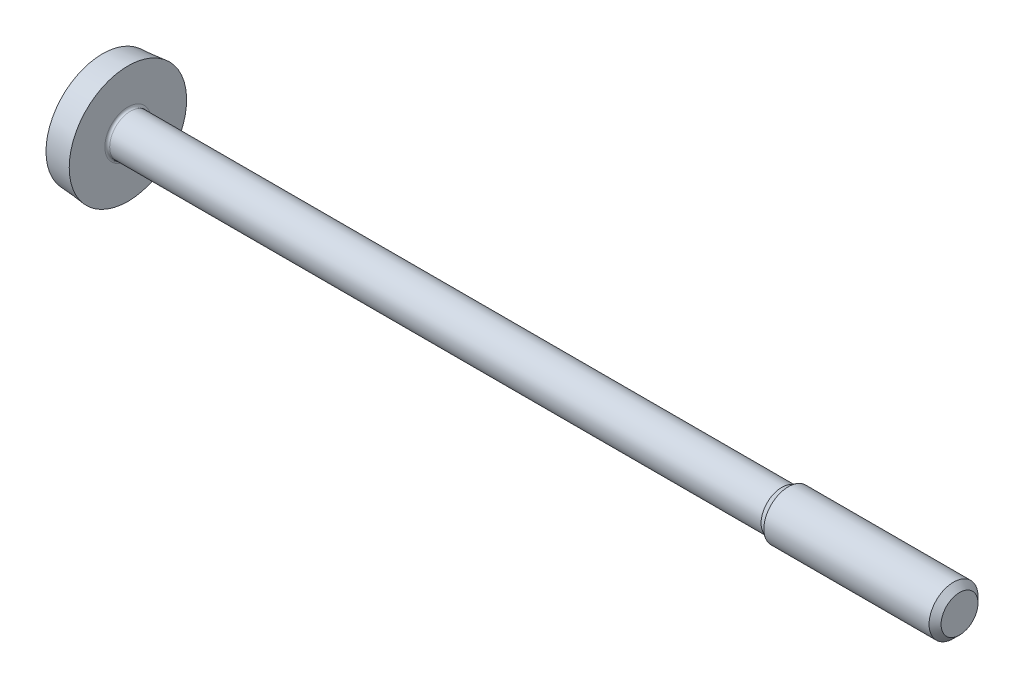
ISO-10303-21;
HEADER;
FILE_DESCRIPTION(('STEP AP214'),'2;1');
FILE_NAME('part.step','',(''),(''),'','','');
FILE_SCHEMA(('AUTOMOTIVE_DESIGN { 1 0 10303 214 1 1 1 1 }'));
ENDSEC;
DATA;
#1=APPLICATION_CONTEXT('core data for automotive mechanical design processes');
#2=APPLICATION_PROTOCOL_DEFINITION('international standard','automotive_design',2000,#1);
#3=PRODUCT_CONTEXT('',#1,'mechanical');
#4=PRODUCT('Part','Part','',(#3));
#5=PRODUCT_RELATED_PRODUCT_CATEGORY('part','',(#4));
#6=PRODUCT_DEFINITION_FORMATION('','',#4);
#7=PRODUCT_DEFINITION_CONTEXT('part definition',#1,'design');
#8=PRODUCT_DEFINITION('design','',#6,#7);
#9=PRODUCT_DEFINITION_SHAPE('','',#8);
#10=(LENGTH_UNIT() NAMED_UNIT(*) SI_UNIT(.MILLI.,.METRE.));
#11=(NAMED_UNIT(*) PLANE_ANGLE_UNIT() SI_UNIT($,.RADIAN.));
#12=(NAMED_UNIT(*) SI_UNIT($,.STERADIAN.) SOLID_ANGLE_UNIT());
#13=UNCERTAINTY_MEASURE_WITH_UNIT(LENGTH_MEASURE(1.E-05),#10,'distance_accuracy_value','');
#14=(GEOMETRIC_REPRESENTATION_CONTEXT(3) GLOBAL_UNCERTAINTY_ASSIGNED_CONTEXT((#13)) GLOBAL_UNIT_ASSIGNED_CONTEXT((#10,
#11,#12)) REPRESENTATION_CONTEXT('',''));
#15=CARTESIAN_POINT('',(0.,0.,0.));
#16=DIRECTION('',(0.,0.,1.));
#17=DIRECTION('',(1.,0.,0.));
#18=AXIS2_PLACEMENT_3D('',#15,#16,#17);
#19=CARTESIAN_POINT('',(3.44029950540034,2.65954792910694E-13,0.));
#20=DIRECTION('',(-1.,0.,0.));
#21=DIRECTION('',(0.,1.,0.));
#22=AXIS2_PLACEMENT_3D('',#19,#20,#21);
#23=SPHERICAL_SURFACE('',#22,5.04029950540034);
#24=CARTESIAN_POINT('',(3.44029950540034,0.29,0.));
#25=DIRECTION('',(0.,1.,0.));
#26=DIRECTION('',(0.,0.,1.));
#27=AXIS2_PLACEMENT_3D('',#24,#25,#26);
#28=CIRCLE('',#27,5.03194983124226);
#29=CARTESIAN_POINT('',(-1.49128432782597,0.29,-1.));
#30=VERTEX_POINT('',#29);
#31=CARTESIAN_POINT('',(-1.58328677375712,0.29,-0.29));
#32=VERTEX_POINT('',#31);
#33=EDGE_CURVE('E11',#30,#32,#28,.T.);
#34=ORIENTED_EDGE('',*,*,#33,.T.);
#35=CARTESIAN_POINT('',(3.44029950540034,2.65954792910694E-13,-0.29));
#36=DIRECTION('',(0.,0.,-1.));
#37=DIRECTION('',(-1.,0.,0.));
#38=AXIS2_PLACEMENT_3D('',#35,#36,#37);
#39=CIRCLE('',#38,5.03194983124225);
#40=CARTESIAN_POINT('',(-1.04,2.29072814756566,-0.29));
#41=VERTEX_POINT('',#40);
#42=EDGE_CURVE('E178',#32,#41,#39,.T.);
#43=ORIENTED_EDGE('',*,*,#42,.T.);
#44=CARTESIAN_POINT('',(-1.04,0.,0.));
#45=DIRECTION('',(-1.,0.,0.));
#46=DIRECTION('',(0.,0.,1.));
#47=AXIS2_PLACEMENT_3D('',#44,#45,#46);
#48=CIRCLE('',#47,2.309011789933);
#49=CARTESIAN_POINT('',(-1.04,-2.29072814756566,-0.29));
#50=VERTEX_POINT('',#49);
#51=EDGE_CURVE('E208',#41,#50,#48,.T.);
#52=ORIENTED_EDGE('',*,*,#51,.T.);
#53=CARTESIAN_POINT('',(3.44029950540034,2.65954792910694E-13,-0.29));
#54=DIRECTION('',(0.,0.,-1.));
#55=DIRECTION('',(-1.,0.,0.));
#56=AXIS2_PLACEMENT_3D('',#53,#54,#55);
#57=CIRCLE('',#56,5.03194983124225);
#58=CARTESIAN_POINT('',(-1.58328677375709,-0.29,-0.29));
#59=VERTEX_POINT('',#58);
#60=EDGE_CURVE('E175',#50,#59,#57,.T.);
#61=ORIENTED_EDGE('',*,*,#60,.T.);
#62=CARTESIAN_POINT('',(3.44029950540034,-0.29,0.));
#63=DIRECTION('',(0.,-1.,0.));
#64=DIRECTION('',(0.,0.,-1.));
#65=AXIS2_PLACEMENT_3D('',#62,#63,#64);
#66=CIRCLE('',#65,5.03194983124223);
#67=CARTESIAN_POINT('',(-1.49128432782593,-0.29,-1.));
#68=VERTEX_POINT('',#67);
#69=EDGE_CURVE('E215',#59,#68,#66,.T.);
#70=ORIENTED_EDGE('',*,*,#69,.T.);
#71=CARTESIAN_POINT('',(3.44029950540034,2.65954792910694E-13,-1.));
#72=DIRECTION('',(0.,0.,-1.));
#73=DIRECTION('',(-1.,0.,0.));
#74=AXIS2_PLACEMENT_3D('',#71,#72,#73);
#75=CIRCLE('',#74,4.94010314711534);
#76=EDGE_CURVE('E44',#68,#30,#75,.T.);
#77=ORIENTED_EDGE('',*,*,#76,.T.);
#78=EDGE_LOOP('',(#34,#43,#52,#61,#70,#77));
#79=FACE_BOUND('',#78,.T.);
#80=ADVANCED_FACE('F36',(#79),#23,.T.);
#81=CARTESIAN_POINT('',(-1.04,-2.29072814756566,0.29));
#82=VERTEX_POINT('',#81);
#83=CARTESIAN_POINT('',(-1.04,2.29072814756566,0.29));
#84=VERTEX_POINT('',#83);
#85=EDGE_CURVE('E205',#82,#84,#48,.T.);
#86=ORIENTED_EDGE('',*,*,#85,.T.);
#87=CARTESIAN_POINT('',(3.44029950540034,2.65954792910694E-13,0.29));
#88=DIRECTION('',(0.,0.,1.));
#89=DIRECTION('',(1.,0.,0.));
#90=AXIS2_PLACEMENT_3D('',#87,#88,#89);
#91=CIRCLE('',#90,5.03194983124225);
#92=CARTESIAN_POINT('',(-1.58328677375712,0.29,0.29));
#93=VERTEX_POINT('',#92);
#94=EDGE_CURVE('E181',#84,#93,#91,.T.);
#95=ORIENTED_EDGE('',*,*,#94,.T.);
#96=CARTESIAN_POINT('',(3.44029950540034,0.29,0.));
#97=DIRECTION('',(0.,1.,0.));
#98=DIRECTION('',(0.,0.,1.));
#99=AXIS2_PLACEMENT_3D('',#96,#97,#98);
#100=CIRCLE('',#99,5.03194983124226);
#101=CARTESIAN_POINT('',(-1.49128432782597,0.29,1.));
#102=VERTEX_POINT('',#101);
#103=EDGE_CURVE('E213',#93,#102,#100,.T.);
#104=ORIENTED_EDGE('',*,*,#103,.T.);
#105=CARTESIAN_POINT('',(3.44029950540034,2.65954792910694E-13,1.));
#106=DIRECTION('',(0.,0.,1.));
#107=DIRECTION('',(1.,0.,0.));
#108=AXIS2_PLACEMENT_3D('',#105,#106,#107);
#109=CIRCLE('',#108,4.94010314711534);
#110=CARTESIAN_POINT('',(-1.49128432782593,-0.29,1.));
#111=VERTEX_POINT('',#110);
#112=EDGE_CURVE('E119',#102,#111,#109,.T.);
#113=ORIENTED_EDGE('',*,*,#112,.T.);
#114=CARTESIAN_POINT('',(3.44029950540034,-0.29,0.));
#115=DIRECTION('',(0.,-1.,0.));
#116=DIRECTION('',(0.,0.,-1.));
#117=AXIS2_PLACEMENT_3D('',#114,#115,#116);
#118=CIRCLE('',#117,5.03194983124223);
#119=CARTESIAN_POINT('',(-1.58328677375709,-0.29,0.29));
#120=VERTEX_POINT('',#119);
#121=EDGE_CURVE('E210',#111,#120,#118,.T.);
#122=ORIENTED_EDGE('',*,*,#121,.T.);
#123=CARTESIAN_POINT('',(3.44029950540034,2.65954792910694E-13,0.29));
#124=DIRECTION('',(0.,0.,1.));
#125=DIRECTION('',(1.,0.,0.));
#126=AXIS2_PLACEMENT_3D('',#123,#124,#125);
#127=CIRCLE('',#126,5.03194983124225);
#128=EDGE_CURVE('E161',#120,#82,#127,.T.);
#129=ORIENTED_EDGE('',*,*,#128,.T.);
#130=EDGE_LOOP('',(#86,#95,#104,#113,#122,#129));
#131=FACE_BOUND('',#130,.T.);
#132=ADVANCED_FACE('F38',(#131),#23,.T.);
#133=CARTESIAN_POINT('',(0.,0.,0.));
#134=DIRECTION('',(1.,0.,0.));
#135=DIRECTION('',(0.,0.,-1.));
#136=AXIS2_PLACEMENT_3D('',#133,#134,#135);
#137=CONICAL_SURFACE('',#136,2.4,0.0872664625997538);
#138=EDGE_CURVE('E206',#84,#41,#48,.T.);
#139=ORIENTED_EDGE('',*,*,#138,.F.);
#140=ORIENTED_EDGE('',*,*,#85,.F.);
#141=EDGE_CURVE('E238',#50,#82,#48,.T.);
#142=ORIENTED_EDGE('',*,*,#141,.F.);
#143=ORIENTED_EDGE('',*,*,#51,.F.);
#144=EDGE_LOOP('',(#139,#140,#142,#143));
#145=FACE_BOUND('',#144,.T.);
#146=CARTESIAN_POINT('',(0.,0.,0.));
#147=DIRECTION('',(-1.,0.,0.));
#148=DIRECTION('',(0.,0.,1.));
#149=AXIS2_PLACEMENT_3D('',#146,#147,#148);
#150=CIRCLE('',#149,2.4);
#151=CARTESIAN_POINT('',(0.,0.,2.4));
#152=VERTEX_POINT('',#151);
#153=EDGE_CURVE('E202',#152,#152,#150,.T.);
#154=ORIENTED_EDGE('',*,*,#153,.T.);
#155=EDGE_LOOP('',(#154));
#156=FACE_BOUND('',#155,.T.);
#157=ADVANCED_FACE('F235',(#145,#156),#137,.T.);
#158=CARTESIAN_POINT('',(0.,2.4,0.));
#159=DIRECTION('',(-1.,0.,0.));
#160=DIRECTION('',(0.,0.,1.));
#161=AXIS2_PLACEMENT_3D('',#158,#159,#160);
#162=PLANE('',#161);
#163=ORIENTED_EDGE('',*,*,#153,.F.);
#164=EDGE_LOOP('',(#163));
#165=FACE_BOUND('',#164,.T.);
#166=CARTESIAN_POINT('',(0.,0.,0.));
#167=DIRECTION('',(-1.,0.,0.));
#168=DIRECTION('',(0.,0.,1.));
#169=AXIS2_PLACEMENT_3D('',#166,#167,#168);
#170=CIRCLE('',#169,0.945);
#171=CARTESIAN_POINT('',(0.,0.,0.945));
#172=VERTEX_POINT('',#171);
#173=EDGE_CURVE('E199',#172,#172,#170,.T.);
#174=ORIENTED_EDGE('',*,*,#173,.T.);
#175=EDGE_LOOP('',(#174));
#176=FACE_BOUND('',#175,.T.);
#177=ADVANCED_FACE('F265',(#165,#176),#162,.F.);
#178=CARTESIAN_POINT('',(0.100000000000008,0.,0.));
#179=DIRECTION('',(-1.,0.,0.));
#180=DIRECTION('',(0.,0.,1.));
#181=AXIS2_PLACEMENT_3D('',#178,#179,#180);
#182=TOROIDAL_SURFACE('',#181,0.945000000000008,0.100000000000008);
#183=ORIENTED_EDGE('',*,*,#173,.F.);
#184=EDGE_LOOP('',(#183));
#185=FACE_BOUND('',#184,.T.);
#186=CARTESIAN_POINT('',(0.100000000000003,0.,0.));
#187=DIRECTION('',(-1.,0.,0.));
#188=DIRECTION('',(0.,0.,1.));
#189=AXIS2_PLACEMENT_3D('',#186,#187,#188);
#190=CIRCLE('',#189,0.845);
#191=CARTESIAN_POINT('',(0.100000000000003,0.,0.845));
#192=VERTEX_POINT('',#191);
#193=EDGE_CURVE('E196',#192,#192,#190,.T.);
#194=ORIENTED_EDGE('',*,*,#193,.T.);
#195=EDGE_LOOP('',(#194));
#196=FACE_BOUND('',#195,.T.);
#197=ADVANCED_FACE('F269',(#185,#196),#182,.F.);
#198=CARTESIAN_POINT('',(34.,0.,0.));
#199=DIRECTION('',(-1.,0.,0.));
#200=DIRECTION('',(0.,0.,1.));
#201=AXIS2_PLACEMENT_3D('',#198,#199,#200);
#202=CYLINDRICAL_SURFACE('',#201,0.845);
#203=ORIENTED_EDGE('',*,*,#193,.F.);
#204=EDGE_LOOP('',(#203));
#205=FACE_BOUND('',#204,.T.);
#206=CARTESIAN_POINT('',(26.731532124827,0.,0.));
#207=DIRECTION('',(-1.,0.,0.));
#208=DIRECTION('',(0.,0.,1.));
#209=AXIS2_PLACEMENT_3D('',#206,#207,#208);
#210=CIRCLE('',#209,0.845);
#211=CARTESIAN_POINT('',(26.731532124827,0.,0.845));
#212=VERTEX_POINT('',#211);
#213=EDGE_CURVE('E193',#212,#212,#210,.T.);
#214=ORIENTED_EDGE('',*,*,#213,.T.);
#215=EDGE_LOOP('',(#214));
#216=FACE_BOUND('',#215,.T.);
#217=ADVANCED_FACE('F275',(#205,#216),#202,.T.);
#218=CARTESIAN_POINT('',(27.,0.,0.));
#219=DIRECTION('',(1.,0.,0.));
#220=DIRECTION('',(0.,0.,-1.));
#221=AXIS2_PLACEMENT_3D('',#218,#219,#220);
#222=CONICAL_SURFACE('',#221,1.,0.523598775598586);
#223=ORIENTED_EDGE('',*,*,#213,.F.);
#224=EDGE_LOOP('',(#223));
#225=FACE_BOUND('',#224,.T.);
#226=CARTESIAN_POINT('',(27.,0.,0.));
#227=DIRECTION('',(-1.,0.,0.));
#228=DIRECTION('',(0.,0.,1.));
#229=AXIS2_PLACEMENT_3D('',#226,#227,#228);
#230=CIRCLE('',#229,1.);
#231=CARTESIAN_POINT('',(27.,0.,1.));
#232=VERTEX_POINT('',#231);
#233=EDGE_CURVE('E190',#232,#232,#230,.T.);
#234=ORIENTED_EDGE('',*,*,#233,.T.);
#235=EDGE_LOOP('',(#234));
#236=FACE_BOUND('',#235,.T.);
#237=ADVANCED_FACE('F279',(#225,#236),#222,.T.);
#238=CARTESIAN_POINT('',(34.,0.,0.));
#239=DIRECTION('',(-1.,0.,0.));
#240=DIRECTION('',(0.,0.,1.));
#241=AXIS2_PLACEMENT_3D('',#238,#239,#240);
#242=CYLINDRICAL_SURFACE('',#241,1.);
#243=ORIENTED_EDGE('',*,*,#233,.F.);
#244=EDGE_LOOP('',(#243));
#245=FACE_BOUND('',#244,.T.);
#246=CARTESIAN_POINT('',(33.7545,0.,0.));
#247=DIRECTION('',(-1.,0.,0.));
#248=DIRECTION('',(0.,0.,1.));
#249=AXIS2_PLACEMENT_3D('',#246,#247,#248);
#250=CIRCLE('',#249,1.);
#251=CARTESIAN_POINT('',(33.7545,0.,1.));
#252=VERTEX_POINT('',#251);
#253=EDGE_CURVE('E187',#252,#252,#250,.T.);
#254=ORIENTED_EDGE('',*,*,#253,.T.);
#255=EDGE_LOOP('',(#254));
#256=FACE_BOUND('',#255,.T.);
#257=ADVANCED_FACE('F283',(#245,#256),#242,.T.);
#258=CARTESIAN_POINT('',(34.,0.,0.));
#259=DIRECTION('',(-1.,0.,0.));
#260=DIRECTION('',(0.,0.,1.));
#261=AXIS2_PLACEMENT_3D('',#258,#259,#260);
#262=CONICAL_SURFACE('',#261,0.7545,0.785398163397443);
#263=ORIENTED_EDGE('',*,*,#253,.F.);
#264=EDGE_LOOP('',(#263));
#265=FACE_BOUND('',#264,.T.);
#266=CARTESIAN_POINT('',(34.,0.,0.));
#267=DIRECTION('',(-1.,0.,0.));
#268=DIRECTION('',(0.,0.,1.));
#269=AXIS2_PLACEMENT_3D('',#266,#267,#268);
#270=CIRCLE('',#269,0.7545);
#271=CARTESIAN_POINT('',(34.,0.,0.7545));
#272=VERTEX_POINT('',#271);
#273=EDGE_CURVE('E184',#272,#272,#270,.T.);
#274=ORIENTED_EDGE('',*,*,#273,.T.);
#275=EDGE_LOOP('',(#274));
#276=FACE_BOUND('',#275,.T.);
#277=ADVANCED_FACE('F287',(#265,#276),#262,.T.);
#278=CARTESIAN_POINT('',(34.,0.7545,0.));
#279=DIRECTION('',(-1.,0.,0.));
#280=DIRECTION('',(0.,0.,1.));
#281=AXIS2_PLACEMENT_3D('',#278,#279,#280);
#282=PLANE('',#281);
#283=ORIENTED_EDGE('',*,*,#273,.F.);
#284=EDGE_LOOP('',(#283));
#285=FACE_BOUND('',#284,.T.);
#286=ADVANCED_FACE('F291',(#285),#282,.F.);
#287=CARTESIAN_POINT('',(-1.64,0.29,0.29));
#288=DIRECTION('',(0.,1.,0.));
#289=DIRECTION('',(0.,0.,1.));
#290=AXIS2_PLACEMENT_3D('',#287,#288,#289);
#291=PLANE('',#290);
#292=DIRECTION('',(1.,0.,0.));
#293=VECTOR('',#292,1.);
#294=CARTESIAN_POINT('',(-1.64,0.29,0.29));
#295=LINE('',#294,#293);
#296=CARTESIAN_POINT('',(-1.04,0.29,0.29));
#297=VERTEX_POINT('',#296);
#298=EDGE_CURVE('E138',#93,#297,#295,.T.);
#299=ORIENTED_EDGE('',*,*,#298,.T.);
#300=DIRECTION('',(0.,0.,1.));
#301=VECTOR('',#300,1.);
#302=CARTESIAN_POINT('',(-1.04,0.29,0.29));
#303=LINE('',#302,#301);
#304=CARTESIAN_POINT('',(-1.04,0.29,1.));
#305=VERTEX_POINT('',#304);
#306=EDGE_CURVE('E131',#297,#305,#303,.T.);
#307=ORIENTED_EDGE('',*,*,#306,.T.);
#308=DIRECTION('',(1.,0.,0.));
#309=VECTOR('',#308,1.);
#310=CARTESIAN_POINT('',(-1.64,0.29,1.));
#311=LINE('',#310,#309);
#312=EDGE_CURVE('E113',#102,#305,#311,.T.);
#313=ORIENTED_EDGE('',*,*,#312,.F.);
#314=ORIENTED_EDGE('',*,*,#103,.F.);
#315=EDGE_LOOP('',(#299,#307,#313,#314));
#316=FACE_BOUND('',#315,.T.);
#317=ADVANCED_FACE('F136',(#316),#291,.F.);
#318=CARTESIAN_POINT('',(-1.64,0.29,-1.));
#319=DIRECTION('',(0.,1.,0.));
#320=DIRECTION('',(0.,0.,1.));
#321=AXIS2_PLACEMENT_3D('',#318,#319,#320);
#322=PLANE('',#321);
#323=DIRECTION('',(1.,0.,0.));
#324=VECTOR('',#323,1.);
#325=CARTESIAN_POINT('',(-1.64,0.29,-1.));
#326=LINE('',#325,#324);
#327=CARTESIAN_POINT('',(-1.04,0.29,-1.));
#328=VERTEX_POINT('',#327);
#329=EDGE_CURVE('E164',#30,#328,#326,.T.);
#330=ORIENTED_EDGE('',*,*,#329,.T.);
#331=DIRECTION('',(0.,0.,1.));
#332=VECTOR('',#331,1.);
#333=CARTESIAN_POINT('',(-1.04,0.29,-1.));
#334=LINE('',#333,#332);
#335=CARTESIAN_POINT('',(-1.04,0.29,-0.29));
#336=VERTEX_POINT('',#335);
#337=EDGE_CURVE('E153',#328,#336,#334,.T.);
#338=ORIENTED_EDGE('',*,*,#337,.T.);
#339=DIRECTION('',(1.,0.,0.));
#340=VECTOR('',#339,1.);
#341=CARTESIAN_POINT('',(-1.64,0.29,-0.29));
#342=LINE('',#341,#340);
#343=EDGE_CURVE('E162',#32,#336,#342,.T.);
#344=ORIENTED_EDGE('',*,*,#343,.F.);
#345=ORIENTED_EDGE('',*,*,#33,.F.);
#346=EDGE_LOOP('',(#330,#338,#344,#345));
#347=FACE_BOUND('',#346,.T.);
#348=ADVANCED_FACE('F227',(#347),#322,.F.);
#349=CARTESIAN_POINT('',(-1.64,-0.29,-1.));
#350=DIRECTION('',(0.,0.,-1.));
#351=DIRECTION('',(-1.,0.,0.));
#352=AXIS2_PLACEMENT_3D('',#349,#350,#351);
#353=PLANE('',#352);
#354=DIRECTION('',(1.,0.,0.));
#355=VECTOR('',#354,1.);
#356=CARTESIAN_POINT('',(-1.64,-0.29,-1.));
#357=LINE('',#356,#355);
#358=CARTESIAN_POINT('',(-1.04,-0.29,-1.));
#359=VERTEX_POINT('',#358);
#360=EDGE_CURVE('E166',#68,#359,#357,.T.);
#361=ORIENTED_EDGE('',*,*,#360,.T.);
#362=DIRECTION('',(0.,1.,0.));
#363=VECTOR('',#362,1.);
#364=CARTESIAN_POINT('',(-1.04,-0.29,-1.));
#365=LINE('',#364,#363);
#366=EDGE_CURVE('E150',#359,#328,#365,.T.);
#367=ORIENTED_EDGE('',*,*,#366,.T.);
#368=ORIENTED_EDGE('',*,*,#329,.F.);
#369=ORIENTED_EDGE('',*,*,#76,.F.);
#370=EDGE_LOOP('',(#361,#367,#368,#369));
#371=FACE_BOUND('',#370,.T.);
#372=ADVANCED_FACE('F221',(#371),#353,.F.);
#373=CARTESIAN_POINT('',(-1.64,-0.29,-0.29));
#374=DIRECTION('',(0.,-1.,0.));
#375=DIRECTION('',(0.,0.,-1.));
#376=AXIS2_PLACEMENT_3D('',#373,#374,#375);
#377=PLANE('',#376);
#378=DIRECTION('',(1.,0.,0.));
#379=VECTOR('',#378,1.);
#380=CARTESIAN_POINT('',(-1.64,-0.29,-0.29));
#381=LINE('',#380,#379);
#382=CARTESIAN_POINT('',(-1.04,-0.29,-0.29));
#383=VERTEX_POINT('',#382);
#384=EDGE_CURVE('E168',#59,#383,#381,.T.);
#385=ORIENTED_EDGE('',*,*,#384,.T.);
#386=DIRECTION('',(0.,0.,-1.));
#387=VECTOR('',#386,1.);
#388=CARTESIAN_POINT('',(-1.04,-0.29,-0.29));
#389=LINE('',#388,#387);
#390=EDGE_CURVE('E147',#383,#359,#389,.T.);
#391=ORIENTED_EDGE('',*,*,#390,.T.);
#392=ORIENTED_EDGE('',*,*,#360,.F.);
#393=ORIENTED_EDGE('',*,*,#69,.F.);
#394=EDGE_LOOP('',(#385,#391,#392,#393));
#395=FACE_BOUND('',#394,.T.);
#396=ADVANCED_FACE('F224',(#395),#377,.F.);
#397=CARTESIAN_POINT('',(-1.64,-0.29,1.));
#398=DIRECTION('',(0.,-1.,0.));
#399=DIRECTION('',(0.,0.,-1.));
#400=AXIS2_PLACEMENT_3D('',#397,#398,#399);
#401=PLANE('',#400);
#402=DIRECTION('',(1.,0.,0.));
#403=VECTOR('',#402,1.);
#404=CARTESIAN_POINT('',(-1.64,-0.29,1.));
#405=LINE('',#404,#403);
#406=CARTESIAN_POINT('',(-1.04,-0.29,1.));
#407=VERTEX_POINT('',#406);
#408=EDGE_CURVE('E123',#111,#407,#405,.T.);
#409=ORIENTED_EDGE('',*,*,#408,.T.);
#410=DIRECTION('',(0.,0.,-1.));
#411=VECTOR('',#410,1.);
#412=CARTESIAN_POINT('',(-1.04,-0.29,1.));
#413=LINE('',#412,#411);
#414=CARTESIAN_POINT('',(-1.04,-0.29,0.29));
#415=VERTEX_POINT('',#414);
#416=EDGE_CURVE('E134',#407,#415,#413,.T.);
#417=ORIENTED_EDGE('',*,*,#416,.T.);
#418=DIRECTION('',(1.,0.,0.));
#419=VECTOR('',#418,1.);
#420=CARTESIAN_POINT('',(-1.64,-0.29,0.29));
#421=LINE('',#420,#419);
#422=EDGE_CURVE('E170',#120,#415,#421,.T.);
#423=ORIENTED_EDGE('',*,*,#422,.F.);
#424=ORIENTED_EDGE('',*,*,#121,.F.);
#425=EDGE_LOOP('',(#409,#417,#423,#424));
#426=FACE_BOUND('',#425,.T.);
#427=ADVANCED_FACE('F245',(#426),#401,.F.);
#428=CARTESIAN_POINT('',(-1.64,0.29,1.));
#429=DIRECTION('',(0.,0.,1.));
#430=DIRECTION('',(1.,0.,0.));
#431=AXIS2_PLACEMENT_3D('',#428,#429,#430);
#432=PLANE('',#431);
#433=ORIENTED_EDGE('',*,*,#312,.T.);
#434=DIRECTION('',(0.,-1.,0.));
#435=VECTOR('',#434,1.);
#436=CARTESIAN_POINT('',(-1.04,0.29,1.));
#437=LINE('',#436,#435);
#438=EDGE_CURVE('E117',#305,#407,#437,.T.);
#439=ORIENTED_EDGE('',*,*,#438,.T.);
#440=ORIENTED_EDGE('',*,*,#408,.F.);
#441=ORIENTED_EDGE('',*,*,#112,.F.);
#442=EDGE_LOOP('',(#433,#439,#440,#441));
#443=FACE_BOUND('',#442,.T.);
#444=ADVANCED_FACE('F115',(#443),#432,.F.);
#445=CARTESIAN_POINT('',(-1.64,2.5,0.29));
#446=DIRECTION('',(0.,0.,1.));
#447=DIRECTION('',(1.,0.,0.));
#448=AXIS2_PLACEMENT_3D('',#445,#446,#447);
#449=PLANE('',#448);
#450=DIRECTION('',(0.,-1.,0.));
#451=VECTOR('',#450,1.);
#452=CARTESIAN_POINT('',(-1.04,2.5,0.29));
#453=LINE('',#452,#451);
#454=EDGE_CURVE('E124',#84,#297,#453,.T.);
#455=ORIENTED_EDGE('',*,*,#454,.T.);
#456=ORIENTED_EDGE('',*,*,#298,.F.);
#457=ORIENTED_EDGE('',*,*,#94,.F.);
#458=EDGE_LOOP('',(#455,#456,#457));
#459=FACE_BOUND('',#458,.T.);
#460=ADVANCED_FACE('F247',(#459),#449,.F.);
#461=CARTESIAN_POINT('',(-1.64,0.29,-0.29));
#462=DIRECTION('',(0.,0.,-1.));
#463=DIRECTION('',(-1.,0.,0.));
#464=AXIS2_PLACEMENT_3D('',#461,#462,#463);
#465=PLANE('',#464);
#466=ORIENTED_EDGE('',*,*,#343,.T.);
#467=DIRECTION('',(0.,1.,0.));
#468=VECTOR('',#467,1.);
#469=CARTESIAN_POINT('',(-1.04,0.29,-0.29));
#470=LINE('',#469,#468);
#471=EDGE_CURVE('E156',#336,#41,#470,.T.);
#472=ORIENTED_EDGE('',*,*,#471,.T.);
#473=ORIENTED_EDGE('',*,*,#42,.F.);
#474=EDGE_LOOP('',(#466,#472,#473));
#475=FACE_BOUND('',#474,.T.);
#476=ADVANCED_FACE('F229',(#475),#465,.F.);
#477=CARTESIAN_POINT('',(-1.64,-2.5,-0.29));
#478=DIRECTION('',(0.,0.,-1.));
#479=DIRECTION('',(-1.,0.,0.));
#480=AXIS2_PLACEMENT_3D('',#477,#478,#479);
#481=PLANE('',#480);
#482=DIRECTION('',(0.,1.,0.));
#483=VECTOR('',#482,1.);
#484=CARTESIAN_POINT('',(-1.04,-2.5,-0.29));
#485=LINE('',#484,#483);
#486=EDGE_CURVE('E51',#50,#383,#485,.T.);
#487=ORIENTED_EDGE('',*,*,#486,.T.);
#488=ORIENTED_EDGE('',*,*,#384,.F.);
#489=ORIENTED_EDGE('',*,*,#60,.F.);
#490=EDGE_LOOP('',(#487,#488,#489));
#491=FACE_BOUND('',#490,.T.);
#492=ADVANCED_FACE('F254',(#491),#481,.F.);
#493=CARTESIAN_POINT('',(-1.64,-0.29,0.29));
#494=DIRECTION('',(0.,0.,1.));
#495=DIRECTION('',(1.,0.,0.));
#496=AXIS2_PLACEMENT_3D('',#493,#494,#495);
#497=PLANE('',#496);
#498=ORIENTED_EDGE('',*,*,#422,.T.);
#499=DIRECTION('',(0.,-1.,0.));
#500=VECTOR('',#499,1.);
#501=CARTESIAN_POINT('',(-1.04,-0.29,0.29));
#502=LINE('',#501,#500);
#503=EDGE_CURVE('E143',#415,#82,#502,.T.);
#504=ORIENTED_EDGE('',*,*,#503,.T.);
#505=ORIENTED_EDGE('',*,*,#128,.F.);
#506=EDGE_LOOP('',(#498,#504,#505));
#507=FACE_BOUND('',#506,.T.);
#508=ADVANCED_FACE('F243',(#507),#497,.F.);
#509=CARTESIAN_POINT('',(-1.04,0.,0.));
#510=DIRECTION('',(1.,0.,0.));
#511=DIRECTION('',(0.,0.,-1.));
#512=AXIS2_PLACEMENT_3D('',#509,#510,#511);
#513=PLANE('',#512);
#514=ORIENTED_EDGE('',*,*,#471,.F.);
#515=ORIENTED_EDGE('',*,*,#337,.F.);
#516=ORIENTED_EDGE('',*,*,#366,.F.);
#517=ORIENTED_EDGE('',*,*,#390,.F.);
#518=ORIENTED_EDGE('',*,*,#486,.F.);
#519=ORIENTED_EDGE('',*,*,#141,.T.);
#520=ORIENTED_EDGE('',*,*,#503,.F.);
#521=ORIENTED_EDGE('',*,*,#416,.F.);
#522=ORIENTED_EDGE('',*,*,#438,.F.);
#523=ORIENTED_EDGE('',*,*,#306,.F.);
#524=ORIENTED_EDGE('',*,*,#454,.F.);
#525=ORIENTED_EDGE('',*,*,#138,.T.);
#526=EDGE_LOOP('',(#514,#515,#516,#517,#518,#519,#520,#521,#522,#523,#524,#525));
#527=FACE_BOUND('',#526,.T.);
#528=ADVANCED_FACE('F129',(#527),#513,.F.);
#529=CLOSED_SHELL('',(#80,#132,#157,#177,#197,#217,#237,#257,#277,#286,#317,#348,#372,#396,#427,
#444,#460,#476,#492,#508,#528));
#530=MANIFOLD_SOLID_BREP('B2',#529);
#531=ADVANCED_BREP_SHAPE_REPRESENTATION('',(#18,#530),#14);
#532=SHAPE_DEFINITION_REPRESENTATION(#9,#531);
ENDSEC;
END-ISO-10303-21;
